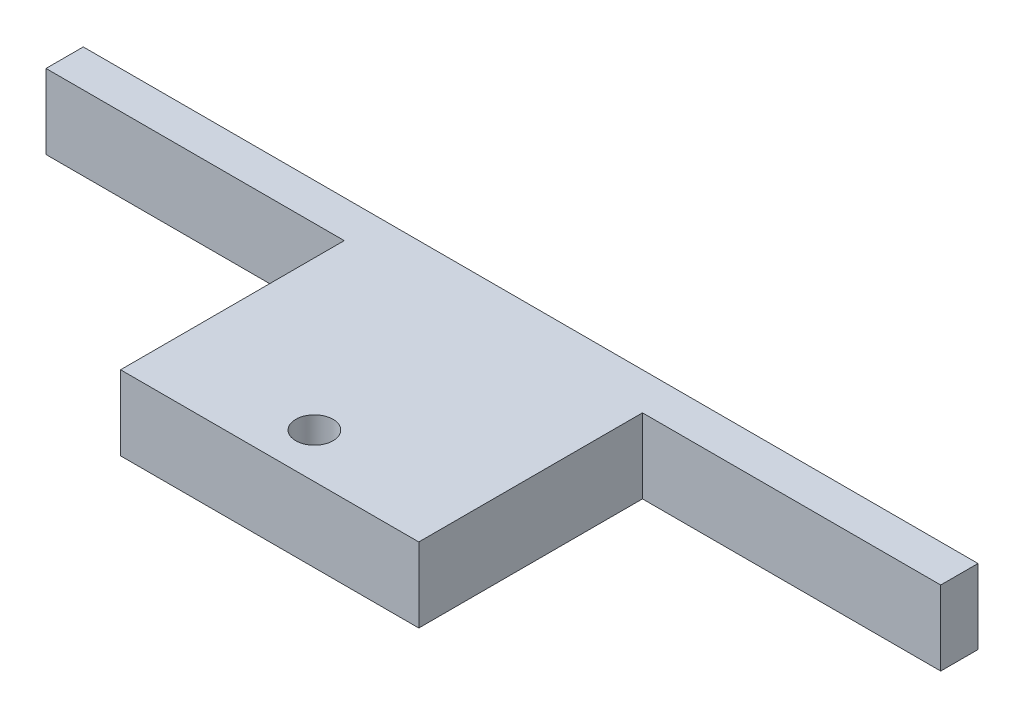
ISO-10303-21;
HEADER;
FILE_DESCRIPTION(('STEP AP214'),'2;1');
FILE_NAME('part.step','',(''),(''),'','','');
FILE_SCHEMA(('AUTOMOTIVE_DESIGN { 1 0 10303 214 1 1 1 1 }'));
ENDSEC;
DATA;
#1=APPLICATION_CONTEXT('core data for automotive mechanical design processes');
#2=APPLICATION_PROTOCOL_DEFINITION('international standard','automotive_design',2000,#1);
#3=PRODUCT_CONTEXT('',#1,'mechanical');
#4=PRODUCT('Part','Part','',(#3));
#5=PRODUCT_RELATED_PRODUCT_CATEGORY('part','',(#4));
#6=PRODUCT_DEFINITION_FORMATION('','',#4);
#7=PRODUCT_DEFINITION_CONTEXT('part definition',#1,'design');
#8=PRODUCT_DEFINITION('design','',#6,#7);
#9=PRODUCT_DEFINITION_SHAPE('','',#8);
#10=(LENGTH_UNIT() NAMED_UNIT(*) SI_UNIT(.MILLI.,.METRE.));
#11=(NAMED_UNIT(*) PLANE_ANGLE_UNIT() SI_UNIT($,.RADIAN.));
#12=(NAMED_UNIT(*) SI_UNIT($,.STERADIAN.) SOLID_ANGLE_UNIT());
#13=UNCERTAINTY_MEASURE_WITH_UNIT(LENGTH_MEASURE(1.E-05),#10,'distance_accuracy_value','');
#14=(GEOMETRIC_REPRESENTATION_CONTEXT(3) GLOBAL_UNCERTAINTY_ASSIGNED_CONTEXT((#13)) GLOBAL_UNIT_ASSIGNED_CONTEXT((#10,
#11,#12)) REPRESENTATION_CONTEXT('',''));
#15=CARTESIAN_POINT('',(0.,0.,0.));
#16=DIRECTION('',(0.,0.,1.));
#17=DIRECTION('',(1.,0.,0.));
#18=AXIS2_PLACEMENT_3D('',#15,#16,#17);
#19=CARTESIAN_POINT('',(0.,38.1,0.));
#20=DIRECTION('',(0.,0.,-1.));
#21=DIRECTION('',(-1.,0.,0.));
#22=AXIS2_PLACEMENT_3D('',#19,#20,#21);
#23=PLANE('',#22);
#24=DIRECTION('',(1.,0.,0.));
#25=VECTOR('',#24,1.);
#26=CARTESIAN_POINT('',(0.,0.,0.));
#27=LINE('',#26,#25);
#28=CARTESIAN_POINT('',(0.,0.,0.));
#29=VERTEX_POINT('',#28);
#30=CARTESIAN_POINT('',(152.4,0.,0.));
#31=VERTEX_POINT('',#30);
#32=EDGE_CURVE('E128',#29,#31,#27,.T.);
#33=ORIENTED_EDGE('',*,*,#32,.T.);
#34=DIRECTION('',(0.,-1.,0.));
#35=VECTOR('',#34,1.);
#36=CARTESIAN_POINT('',(152.4,38.1,0.));
#37=LINE('',#36,#35);
#38=CARTESIAN_POINT('',(152.4,38.1,0.));
#39=VERTEX_POINT('',#38);
#40=EDGE_CURVE('E11',#39,#31,#37,.T.);
#41=ORIENTED_EDGE('',*,*,#40,.F.);
#42=DIRECTION('',(1.,0.,0.));
#43=VECTOR('',#42,1.);
#44=CARTESIAN_POINT('',(0.,38.1,0.));
#45=LINE('',#44,#43);
#46=CARTESIAN_POINT('',(0.,38.1,0.));
#47=VERTEX_POINT('',#46);
#48=EDGE_CURVE('E136',#47,#39,#45,.T.);
#49=ORIENTED_EDGE('',*,*,#48,.F.);
#50=DIRECTION('',(0.,-1.,0.));
#51=VECTOR('',#50,1.);
#52=CARTESIAN_POINT('',(0.,38.1,0.));
#53=LINE('',#52,#51);
#54=EDGE_CURVE('E48',#47,#29,#53,.T.);
#55=ORIENTED_EDGE('',*,*,#54,.T.);
#56=EDGE_LOOP('',(#33,#41,#49,#55));
#57=FACE_BOUND('',#56,.T.);
#58=ADVANCED_FACE('F32',(#57),#23,.F.);
#59=CARTESIAN_POINT('',(152.4,38.1,0.));
#60=DIRECTION('',(-1.,0.,0.));
#61=DIRECTION('',(0.,0.,1.));
#62=AXIS2_PLACEMENT_3D('',#59,#60,#61);
#63=PLANE('',#62);
#64=DIRECTION('',(0.,0.,-1.));
#65=VECTOR('',#64,1.);
#66=CARTESIAN_POINT('',(152.4,0.,0.));
#67=LINE('',#66,#65);
#68=CARTESIAN_POINT('',(152.4,0.,-114.3));
#69=VERTEX_POINT('',#68);
#70=EDGE_CURVE('E130',#31,#69,#67,.T.);
#71=ORIENTED_EDGE('',*,*,#70,.T.);
#72=DIRECTION('',(0.,-1.,0.));
#73=VECTOR('',#72,1.);
#74=CARTESIAN_POINT('',(152.4,38.1,-114.3));
#75=LINE('',#74,#73);
#76=CARTESIAN_POINT('',(152.4,38.1,-114.3));
#77=VERTEX_POINT('',#76);
#78=EDGE_CURVE('E40',#77,#69,#75,.T.);
#79=ORIENTED_EDGE('',*,*,#78,.F.);
#80=DIRECTION('',(0.,0.,-1.));
#81=VECTOR('',#80,1.);
#82=CARTESIAN_POINT('',(152.4,38.1,0.));
#83=LINE('',#82,#81);
#84=EDGE_CURVE('E71',#39,#77,#83,.T.);
#85=ORIENTED_EDGE('',*,*,#84,.F.);
#86=ORIENTED_EDGE('',*,*,#40,.T.);
#87=EDGE_LOOP('',(#71,#79,#85,#86));
#88=FACE_BOUND('',#87,.T.);
#89=ADVANCED_FACE('F189',(#88),#63,.F.);
#90=CARTESIAN_POINT('',(0.,38.1,0.));
#91=DIRECTION('',(-1.,0.,0.));
#92=DIRECTION('',(0.,0.,1.));
#93=AXIS2_PLACEMENT_3D('',#90,#91,#92);
#94=PLANE('',#93);
#95=DIRECTION('',(0.,0.,-1.));
#96=VECTOR('',#95,1.);
#97=CARTESIAN_POINT('',(0.,0.,0.));
#98=LINE('',#97,#96);
#99=CARTESIAN_POINT('',(0.,0.,-114.3));
#100=VERTEX_POINT('',#99);
#101=EDGE_CURVE('E138',#29,#100,#98,.T.);
#102=ORIENTED_EDGE('',*,*,#101,.F.);
#103=ORIENTED_EDGE('',*,*,#54,.F.);
#104=DIRECTION('',(0.,0.,-1.));
#105=VECTOR('',#104,1.);
#106=CARTESIAN_POINT('',(0.,38.1,0.));
#107=LINE('',#106,#105);
#108=CARTESIAN_POINT('',(0.,38.1,-114.3));
#109=VERTEX_POINT('',#108);
#110=EDGE_CURVE('E140',#47,#109,#107,.T.);
#111=ORIENTED_EDGE('',*,*,#110,.T.);
#112=DIRECTION('',(0.,-1.,0.));
#113=VECTOR('',#112,1.);
#114=CARTESIAN_POINT('',(0.,38.1,-114.3));
#115=LINE('',#114,#113);
#116=EDGE_CURVE('E60',#109,#100,#115,.T.);
#117=ORIENTED_EDGE('',*,*,#116,.T.);
#118=EDGE_LOOP('',(#102,#103,#111,#117));
#119=FACE_BOUND('',#118,.T.);
#120=ADVANCED_FACE('F193',(#119),#94,.T.);
#121=CARTESIAN_POINT('',(0.,38.1,0.));
#122=DIRECTION('',(0.,1.,0.));
#123=DIRECTION('',(0.,0.,1.));
#124=AXIS2_PLACEMENT_3D('',#121,#122,#123);
#125=PLANE('',#124);
#126=CARTESIAN_POINT('',(76.2,38.1,-22.86));
#127=DIRECTION('',(0.,-1.,0.));
#128=DIRECTION('',(0.,0.,-1.));
#129=AXIS2_PLACEMENT_3D('',#126,#127,#128);
#130=CIRCLE('',#129,9.52499999999998);
#131=CARTESIAN_POINT('',(76.2,38.1,-32.385));
#132=VERTEX_POINT('',#131);
#133=EDGE_CURVE('E167',#132,#132,#130,.T.);
#134=ORIENTED_EDGE('',*,*,#133,.T.);
#135=EDGE_LOOP('',(#134));
#136=FACE_BOUND('',#135,.T.);
#137=ORIENTED_EDGE('',*,*,#48,.T.);
#138=ORIENTED_EDGE('',*,*,#84,.T.);
#139=DIRECTION('',(1.,0.,0.));
#140=VECTOR('',#139,1.);
#141=CARTESIAN_POINT('',(-152.4,38.1,-114.3));
#142=LINE('',#141,#140);
#143=CARTESIAN_POINT('',(304.8,38.1,-114.3));
#144=VERTEX_POINT('',#143);
#145=EDGE_CURVE('E152',#77,#144,#142,.T.);
#146=ORIENTED_EDGE('',*,*,#145,.T.);
#147=DIRECTION('',(0.,0.,1.));
#148=VECTOR('',#147,1.);
#149=CARTESIAN_POINT('',(304.8,38.1,-133.35));
#150=LINE('',#149,#148);
#151=CARTESIAN_POINT('',(304.8,38.1,-133.35));
#152=VERTEX_POINT('',#151);
#153=EDGE_CURVE('E110',#152,#144,#150,.T.);
#154=ORIENTED_EDGE('',*,*,#153,.F.);
#155=DIRECTION('',(1.,0.,0.));
#156=VECTOR('',#155,1.);
#157=CARTESIAN_POINT('',(-152.4,38.1,-133.35));
#158=LINE('',#157,#156);
#159=CARTESIAN_POINT('',(-152.4,38.1,-133.35));
#160=VERTEX_POINT('',#159);
#161=EDGE_CURVE('E102',#160,#152,#158,.T.);
#162=ORIENTED_EDGE('',*,*,#161,.F.);
#163=DIRECTION('',(0.,0.,1.));
#164=VECTOR('',#163,1.);
#165=CARTESIAN_POINT('',(-152.4,38.1,-133.35));
#166=LINE('',#165,#164);
#167=CARTESIAN_POINT('',(-152.4,38.1,-114.3));
#168=VERTEX_POINT('',#167);
#169=EDGE_CURVE('E107',#160,#168,#166,.T.);
#170=ORIENTED_EDGE('',*,*,#169,.T.);
#171=EDGE_CURVE('E168',#168,#109,#142,.T.);
#172=ORIENTED_EDGE('',*,*,#171,.T.);
#173=ORIENTED_EDGE('',*,*,#110,.F.);
#174=EDGE_LOOP('',(#137,#138,#146,#154,#162,#170,#172,#173));
#175=FACE_BOUND('',#174,.T.);
#176=ADVANCED_FACE('F104',(#136,#175),#125,.T.);
#177=CARTESIAN_POINT('',(0.,0.,0.));
#178=DIRECTION('',(0.,1.,0.));
#179=DIRECTION('',(0.,0.,1.));
#180=AXIS2_PLACEMENT_3D('',#177,#178,#179);
#181=PLANE('',#180);
#182=CARTESIAN_POINT('',(76.2,0.,-22.86));
#183=DIRECTION('',(0.,-1.,0.));
#184=DIRECTION('',(0.,0.,-1.));
#185=AXIS2_PLACEMENT_3D('',#182,#183,#184);
#186=CIRCLE('',#185,9.52499999999999);
#187=CARTESIAN_POINT('',(76.2,0.,-32.385));
#188=VERTEX_POINT('',#187);
#189=EDGE_CURVE('E218',#188,#188,#186,.T.);
#190=ORIENTED_EDGE('',*,*,#189,.F.);
#191=EDGE_LOOP('',(#190));
#192=FACE_BOUND('',#191,.T.);
#193=ORIENTED_EDGE('',*,*,#32,.F.);
#194=ORIENTED_EDGE('',*,*,#101,.T.);
#195=DIRECTION('',(-1.,0.,0.));
#196=VECTOR('',#195,1.);
#197=CARTESIAN_POINT('',(-152.4,0.,-114.3));
#198=LINE('',#197,#196);
#199=CARTESIAN_POINT('',(-152.4,0.,-114.3));
#200=VERTEX_POINT('',#199);
#201=EDGE_CURVE('E157',#100,#200,#198,.T.);
#202=ORIENTED_EDGE('',*,*,#201,.T.);
#203=DIRECTION('',(0.,0.,1.));
#204=VECTOR('',#203,1.);
#205=CARTESIAN_POINT('',(-152.4,0.,-133.35));
#206=LINE('',#205,#204);
#207=CARTESIAN_POINT('',(-152.4,0.,-133.35));
#208=VERTEX_POINT('',#207);
#209=EDGE_CURVE('E163',#208,#200,#206,.T.);
#210=ORIENTED_EDGE('',*,*,#209,.F.);
#211=DIRECTION('',(-1.,0.,0.));
#212=VECTOR('',#211,1.);
#213=CARTESIAN_POINT('',(-152.4,0.,-133.35));
#214=LINE('',#213,#212);
#215=CARTESIAN_POINT('',(304.8,0.,-133.35));
#216=VERTEX_POINT('',#215);
#217=EDGE_CURVE('E119',#216,#208,#214,.T.);
#218=ORIENTED_EDGE('',*,*,#217,.F.);
#219=DIRECTION('',(0.,0.,1.));
#220=VECTOR('',#219,1.);
#221=CARTESIAN_POINT('',(304.8,0.,-133.35));
#222=LINE('',#221,#220);
#223=CARTESIAN_POINT('',(304.8,0.,-114.3));
#224=VERTEX_POINT('',#223);
#225=EDGE_CURVE('E132',#216,#224,#222,.T.);
#226=ORIENTED_EDGE('',*,*,#225,.T.);
#227=EDGE_CURVE('E123',#224,#69,#198,.T.);
#228=ORIENTED_EDGE('',*,*,#227,.T.);
#229=ORIENTED_EDGE('',*,*,#70,.F.);
#230=EDGE_LOOP('',(#193,#194,#202,#210,#218,#226,#228,#229));
#231=FACE_BOUND('',#230,.T.);
#232=ADVANCED_FACE('F155',(#192,#231),#181,.F.);
#233=CARTESIAN_POINT('',(0.,0.,-114.3));
#234=DIRECTION('',(0.,0.,1.));
#235=DIRECTION('',(1.,0.,0.));
#236=AXIS2_PLACEMENT_3D('',#233,#234,#235);
#237=PLANE('',#236);
#238=ORIENTED_EDGE('',*,*,#116,.F.);
#239=ORIENTED_EDGE('',*,*,#171,.F.);
#240=DIRECTION('',(0.,1.,0.));
#241=VECTOR('',#240,1.);
#242=CARTESIAN_POINT('',(-152.4,38.1,-114.3));
#243=LINE('',#242,#241);
#244=EDGE_CURVE('E127',#200,#168,#243,.T.);
#245=ORIENTED_EDGE('',*,*,#244,.F.);
#246=ORIENTED_EDGE('',*,*,#201,.F.);
#247=EDGE_LOOP('',(#238,#239,#245,#246));
#248=FACE_BOUND('',#247,.T.);
#249=ADVANCED_FACE('F174',(#248),#237,.T.);
#250=CARTESIAN_POINT('',(-152.4,38.1,-133.35));
#251=DIRECTION('',(1.,0.,0.));
#252=DIRECTION('',(0.,0.,-1.));
#253=AXIS2_PLACEMENT_3D('',#250,#251,#252);
#254=PLANE('',#253);
#255=ORIENTED_EDGE('',*,*,#244,.T.);
#256=ORIENTED_EDGE('',*,*,#169,.F.);
#257=DIRECTION('',(0.,1.,0.));
#258=VECTOR('',#257,1.);
#259=CARTESIAN_POINT('',(-152.4,38.1,-133.35));
#260=LINE('',#259,#258);
#261=EDGE_CURVE('E114',#208,#160,#260,.T.);
#262=ORIENTED_EDGE('',*,*,#261,.F.);
#263=ORIENTED_EDGE('',*,*,#209,.T.);
#264=EDGE_LOOP('',(#255,#256,#262,#263));
#265=FACE_BOUND('',#264,.T.);
#266=ADVANCED_FACE('F125',(#265),#254,.F.);
#267=CARTESIAN_POINT('',(304.8,38.1,-133.35));
#268=DIRECTION('',(-1.,0.,0.));
#269=DIRECTION('',(0.,0.,1.));
#270=AXIS2_PLACEMENT_3D('',#267,#268,#269);
#271=PLANE('',#270);
#272=DIRECTION('',(0.,-1.,0.));
#273=VECTOR('',#272,1.);
#274=CARTESIAN_POINT('',(304.8,38.1,-114.3));
#275=LINE('',#274,#273);
#276=EDGE_CURVE('E159',#144,#224,#275,.T.);
#277=ORIENTED_EDGE('',*,*,#276,.T.);
#278=ORIENTED_EDGE('',*,*,#225,.F.);
#279=DIRECTION('',(0.,-1.,0.));
#280=VECTOR('',#279,1.);
#281=CARTESIAN_POINT('',(304.8,38.1,-133.35));
#282=LINE('',#281,#280);
#283=EDGE_CURVE('E113',#152,#216,#282,.T.);
#284=ORIENTED_EDGE('',*,*,#283,.F.);
#285=ORIENTED_EDGE('',*,*,#153,.T.);
#286=EDGE_LOOP('',(#277,#278,#284,#285));
#287=FACE_BOUND('',#286,.T.);
#288=ADVANCED_FACE('F171',(#287),#271,.F.);
#289=CARTESIAN_POINT('',(0.,0.,-133.35));
#290=DIRECTION('',(0.,0.,1.));
#291=DIRECTION('',(1.,0.,0.));
#292=AXIS2_PLACEMENT_3D('',#289,#290,#291);
#293=PLANE('',#292);
#294=ORIENTED_EDGE('',*,*,#261,.T.);
#295=ORIENTED_EDGE('',*,*,#161,.T.);
#296=ORIENTED_EDGE('',*,*,#283,.T.);
#297=ORIENTED_EDGE('',*,*,#217,.T.);
#298=EDGE_LOOP('',(#294,#295,#296,#297));
#299=FACE_BOUND('',#298,.T.);
#300=ADVANCED_FACE('F117',(#299),#293,.F.);
#301=ORIENTED_EDGE('',*,*,#145,.F.);
#302=ORIENTED_EDGE('',*,*,#78,.T.);
#303=ORIENTED_EDGE('',*,*,#227,.F.);
#304=ORIENTED_EDGE('',*,*,#276,.F.);
#305=EDGE_LOOP('',(#301,#302,#303,#304));
#306=FACE_BOUND('',#305,.T.);
#307=ADVANCED_FACE('F150',(#306),#237,.T.);
#308=CARTESIAN_POINT('',(76.2,0.,-22.86));
#309=DIRECTION('',(0.,-1.,0.));
#310=DIRECTION('',(0.,0.,-1.));
#311=AXIS2_PLACEMENT_3D('',#308,#309,#310);
#312=CYLINDRICAL_SURFACE('',#311,9.52499999999998);
#313=ORIENTED_EDGE('',*,*,#133,.F.);
#314=EDGE_LOOP('',(#313));
#315=FACE_BOUND('',#314,.T.);
#316=ORIENTED_EDGE('',*,*,#189,.T.);
#317=EDGE_LOOP('',(#316));
#318=FACE_BOUND('',#317,.T.);
#319=ADVANCED_FACE('F187',(#315,#318),#312,.F.);
#320=CLOSED_SHELL('',(#58,#89,#120,#176,#232,#249,#266,#288,#300,#307,#319));
#321=MANIFOLD_SOLID_BREP('B2',#320);
#322=ADVANCED_BREP_SHAPE_REPRESENTATION('',(#18,#321),#14);
#323=SHAPE_DEFINITION_REPRESENTATION(#9,#322);
ENDSEC;
END-ISO-10303-21;
